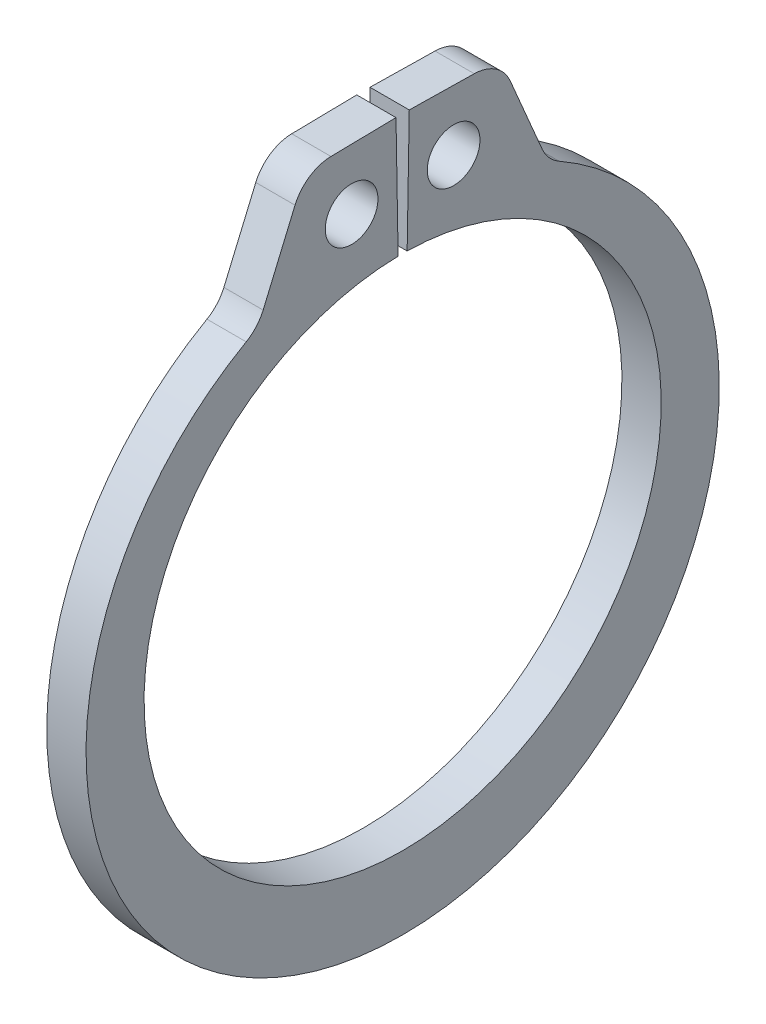
ISO-10303-21;
HEADER;
FILE_DESCRIPTION(('STEP AP214'),'2;1');
FILE_NAME('part.step','',(''),(''),'','','');
FILE_SCHEMA(('AUTOMOTIVE_DESIGN { 1 0 10303 214 1 1 1 1 }'));
ENDSEC;
DATA;
#1=APPLICATION_CONTEXT('core data for automotive mechanical design processes');
#2=APPLICATION_PROTOCOL_DEFINITION('international standard','automotive_design',2000,#1);
#3=PRODUCT_CONTEXT('',#1,'mechanical');
#4=PRODUCT('Part','Part','',(#3));
#5=PRODUCT_RELATED_PRODUCT_CATEGORY('part','',(#4));
#6=PRODUCT_DEFINITION_FORMATION('','',#4);
#7=PRODUCT_DEFINITION_CONTEXT('part definition',#1,'design');
#8=PRODUCT_DEFINITION('design','',#6,#7);
#9=PRODUCT_DEFINITION_SHAPE('','',#8);
#10=(LENGTH_UNIT() NAMED_UNIT(*) SI_UNIT(.MILLI.,.METRE.));
#11=(NAMED_UNIT(*) PLANE_ANGLE_UNIT() SI_UNIT($,.RADIAN.));
#12=(NAMED_UNIT(*) SI_UNIT($,.STERADIAN.) SOLID_ANGLE_UNIT());
#13=UNCERTAINTY_MEASURE_WITH_UNIT(LENGTH_MEASURE(1.E-05),#10,'distance_accuracy_value','');
#14=(GEOMETRIC_REPRESENTATION_CONTEXT(3) GLOBAL_UNCERTAINTY_ASSIGNED_CONTEXT((#13)) GLOBAL_UNIT_ASSIGNED_CONTEXT((#10,
#11,#12)) REPRESENTATION_CONTEXT('',''));
#15=CARTESIAN_POINT('',(0.,0.,0.));
#16=DIRECTION('',(0.,0.,1.));
#17=DIRECTION('',(1.,0.,0.));
#18=AXIS2_PLACEMENT_3D('',#15,#16,#17);
#19=CARTESIAN_POINT('',(-0.4445,0.,0.));
#20=DIRECTION('',(1.,0.,0.));
#21=DIRECTION('',(0.,0.,-1.));
#22=AXIS2_PLACEMENT_3D('',#19,#20,#21);
#23=PLANE('',#22);
#24=CARTESIAN_POINT('',(-0.4445,7.20724610900658,-1.15465964864512));
#25=DIRECTION('',(-1.,0.,0.));
#26=DIRECTION('',(0.,0.,1.));
#27=AXIS2_PLACEMENT_3D('',#24,#25,#26);
#28=CIRCLE('',#27,0.5969);
#29=CARTESIAN_POINT('',(-0.4445,7.20724610900658,-0.557759648645124));
#30=VERTEX_POINT('',#29);
#31=EDGE_CURVE('E133',#30,#30,#28,.F.);
#32=ORIENTED_EDGE('',*,*,#31,.T.);
#33=EDGE_LOOP('',(#32));
#34=FACE_BOUND('',#33,.T.);
#35=CARTESIAN_POINT('',(-0.4445,7.66933071962558,1.60650376158788));
#36=DIRECTION('',(-1.,0.,0.));
#37=DIRECTION('',(0.,0.,1.));
#38=AXIS2_PLACEMENT_3D('',#35,#36,#37);
#39=CIRCLE('',#38,0.9017);
#40=CARTESIAN_POINT('',(-0.4445,8.5708933863481,1.62224059647238));
#41=VERTEX_POINT('',#40);
#42=CARTESIAN_POINT('',(-0.4445,8.02240621636442,2.43620285379096));
#43=VERTEX_POINT('',#42);
#44=EDGE_CURVE('E103',#41,#43,#39,.F.);
#45=ORIENTED_EDGE('',*,*,#44,.F.);
#46=DIRECTION('',(0.,0.01745240643729,-0.999847695156391));
#47=VECTOR('',#46,1.);
#48=CARTESIAN_POINT('',(-0.4445,8.59659049818515,0.15005404530712));
#49=LINE('',#48,#47);
#50=CARTESIAN_POINT('',(-0.4445,8.59659049818515,0.15005404530712));
#51=VERTEX_POINT('',#50);
#52=EDGE_CURVE('E98',#41,#51,#49,.T.);
#53=ORIENTED_EDGE('',*,*,#52,.T.);
#54=DIRECTION('',(0.,-0.999847695156391,-0.0174524064372833));
#55=VECTOR('',#54,1.);
#56=CARTESIAN_POINT('',(-0.4445,5.85380830083213,0.102178603968365));
#57=LINE('',#56,#55);
#58=CARTESIAN_POINT('',(-0.4445,5.85380830083213,0.102178603968365));
#59=VERTEX_POINT('',#58);
#60=EDGE_CURVE('E130',#51,#59,#57,.T.);
#61=ORIENTED_EDGE('',*,*,#60,.T.);
#62=CARTESIAN_POINT('',(-0.4445,0.,0.));
#63=DIRECTION('',(-1.,0.,0.));
#64=DIRECTION('',(0.,0.,1.));
#65=AXIS2_PLACEMENT_3D('',#62,#63,#64);
#66=CIRCLE('',#65,5.8547);
#67=CARTESIAN_POINT('',(-0.4445,5.85380830083213,-0.102178603968365));
#68=VERTEX_POINT('',#67);
#69=EDGE_CURVE('E180',#59,#68,#66,.F.);
#70=ORIENTED_EDGE('',*,*,#69,.T.);
#71=DIRECTION('',(0.,0.999847695156391,-0.0174524064372833));
#72=VECTOR('',#71,1.);
#73=CARTESIAN_POINT('',(-0.4445,5.85380830083213,-0.102178603968365));
#74=LINE('',#73,#72);
#75=CARTESIAN_POINT('',(-0.4445,8.59659049818515,-0.15005404530712));
#76=VERTEX_POINT('',#75);
#77=EDGE_CURVE('E140',#68,#76,#74,.T.);
#78=ORIENTED_EDGE('',*,*,#77,.T.);
#79=DIRECTION('',(0.,-0.01745240643729,-0.999847695156391));
#80=VECTOR('',#79,1.);
#81=CARTESIAN_POINT('',(-0.4445,8.59659049818515,-0.15005404530712));
#82=LINE('',#81,#80);
#83=CARTESIAN_POINT('',(-0.4445,8.5708933863481,-1.62224059647238));
#84=VERTEX_POINT('',#83);
#85=EDGE_CURVE('E147',#76,#84,#82,.T.);
#86=ORIENTED_EDGE('',*,*,#85,.T.);
#87=CARTESIAN_POINT('',(-0.4445,7.66933071962558,-1.60650376158788));
#88=DIRECTION('',(-1.,0.,0.));
#89=DIRECTION('',(0.,0.,1.));
#90=AXIS2_PLACEMENT_3D('',#87,#88,#89);
#91=CIRCLE('',#90,0.9017);
#92=CARTESIAN_POINT('',(-0.4445,8.02240621636442,-2.43620285379096));
#93=VERTEX_POINT('',#92);
#94=EDGE_CURVE('E150',#93,#84,#91,.F.);
#95=ORIENTED_EDGE('',*,*,#94,.F.);
#96=DIRECTION('',(0.,-0.920149819455567,-0.391566481910656));
#97=VECTOR('',#96,1.);
#98=CARTESIAN_POINT('',(-0.4445,8.56068391718107,-2.20714069332188));
#99=LINE('',#98,#97);
#100=CARTESIAN_POINT('',(-0.4445,6.32616456625773,-3.15803245301383));
#101=VERTEX_POINT('',#100);
#102=EDGE_CURVE('E153',#93,#101,#99,.T.);
#103=ORIENTED_EDGE('',*,*,#102,.T.);
#104=CARTESIAN_POINT('',(-0.4445,6.67924006299657,-3.98773154521692));
#105=DIRECTION('',(-1.,0.,0.));
#106=DIRECTION('',(0.,0.,1.));
#107=AXIS2_PLACEMENT_3D('',#104,#105,#106);
#108=CIRCLE('',#107,0.9017);
#109=CARTESIAN_POINT('',(-0.4445,5.89530863003734,-3.54218199868087));
#110=VERTEX_POINT('',#109);
#111=EDGE_CURVE('E186',#101,#110,#108,.F.);
#112=ORIENTED_EDGE('',*,*,#111,.T.);
#113=CARTESIAN_POINT('',(-0.4445,-0.337057291142251,0.));
#114=DIRECTION('',(-1.,0.,0.));
#115=DIRECTION('',(0.,0.,1.));
#116=AXIS2_PLACEMENT_3D('',#113,#114,#115);
#117=CIRCLE('',#116,7.16864270885775);
#118=CARTESIAN_POINT('',(-0.4445,5.89530863003733,3.54218199868087));
#119=VERTEX_POINT('',#118);
#120=EDGE_CURVE('E188',#119,#110,#117,.F.);
#121=ORIENTED_EDGE('',*,*,#120,.F.);
#122=CARTESIAN_POINT('',(-0.4445,6.67924006299657,3.98773154521692));
#123=DIRECTION('',(-1.,0.,0.));
#124=DIRECTION('',(0.,0.,1.));
#125=AXIS2_PLACEMENT_3D('',#122,#123,#124);
#126=CIRCLE('',#125,0.9017);
#127=CARTESIAN_POINT('',(-0.4445,6.32616456625773,3.15803245301383));
#128=VERTEX_POINT('',#127);
#129=EDGE_CURVE('E116',#119,#128,#126,.F.);
#130=ORIENTED_EDGE('',*,*,#129,.T.);
#131=DIRECTION('',(0.,0.920149819455567,-0.391566481910656));
#132=VECTOR('',#131,1.);
#133=CARTESIAN_POINT('',(-0.4445,8.56068391718107,2.20714069332188));
#134=LINE('',#133,#132);
#135=EDGE_CURVE('E113',#128,#43,#134,.T.);
#136=ORIENTED_EDGE('',*,*,#135,.T.);
#137=EDGE_LOOP('',(#45,#53,#61,#70,#78,#86,#95,#103,#112,#121,#130,#136));
#138=FACE_BOUND('',#137,.T.);
#139=CARTESIAN_POINT('',(-0.4445,7.20724610900658,1.15465964864512));
#140=DIRECTION('',(-1.,0.,0.));
#141=DIRECTION('',(0.,0.,1.));
#142=AXIS2_PLACEMENT_3D('',#139,#140,#141);
#143=CIRCLE('',#142,0.5969);
#144=CARTESIAN_POINT('',(-0.4445,7.20724610900658,1.75155964864512));
#145=VERTEX_POINT('',#144);
#146=EDGE_CURVE('E20',#145,#145,#143,.F.);
#147=ORIENTED_EDGE('',*,*,#146,.T.);
#148=EDGE_LOOP('',(#147));
#149=FACE_BOUND('',#148,.T.);
#150=ADVANCED_FACE('F17',(#34,#138,#149),#23,.F.);
#151=CARTESIAN_POINT('',(0.4445,7.20724610900658,1.15465964864512));
#152=DIRECTION('',(-1.,0.,0.));
#153=DIRECTION('',(0.,0.,1.));
#154=AXIS2_PLACEMENT_3D('',#151,#152,#153);
#155=CYLINDRICAL_SURFACE('',#154,0.5969);
#156=CARTESIAN_POINT('',(0.4445,7.20724610900658,1.15465964864512));
#157=DIRECTION('',(-1.,0.,0.));
#158=DIRECTION('',(0.,0.,1.));
#159=AXIS2_PLACEMENT_3D('',#156,#157,#158);
#160=CIRCLE('',#159,0.5969);
#161=CARTESIAN_POINT('',(0.4445,7.20724610900658,1.75155964864512));
#162=VERTEX_POINT('',#161);
#163=EDGE_CURVE('E175',#162,#162,#160,.T.);
#164=ORIENTED_EDGE('',*,*,#163,.F.);
#165=EDGE_LOOP('',(#164));
#166=FACE_BOUND('',#165,.T.);
#167=ORIENTED_EDGE('',*,*,#146,.F.);
#168=EDGE_LOOP('',(#167));
#169=FACE_BOUND('',#168,.T.);
#170=ADVANCED_FACE('F388',(#166,#169),#155,.F.);
#171=CARTESIAN_POINT('',(0.4445,8.59659049818515,0.15005404530712));
#172=DIRECTION('',(0.,-0.999847695156391,-0.01745240643729));
#173=DIRECTION('',(0.,0.01745240643729,-0.999847695156391));
#174=AXIS2_PLACEMENT_3D('',#171,#172,#173);
#175=PLANE('',#174);
#176=DIRECTION('',(-1.,0.,0.));
#177=VECTOR('',#176,1.);
#178=CARTESIAN_POINT('',(0.4445,8.5708933863481,1.62224059647238));
#179=LINE('',#178,#177);
#180=CARTESIAN_POINT('',(0.4445,8.5708933863481,1.62224059647238));
#181=VERTEX_POINT('',#180);
#182=EDGE_CURVE('E110',#181,#41,#179,.T.);
#183=ORIENTED_EDGE('',*,*,#182,.F.);
#184=DIRECTION('',(0.,-0.0174524064372901,0.999847695156391));
#185=VECTOR('',#184,1.);
#186=CARTESIAN_POINT('',(0.4445,8.59659049818515,0.15005404530712));
#187=LINE('',#186,#185);
#188=CARTESIAN_POINT('',(0.4445,8.59659049818515,0.15005404530712));
#189=VERTEX_POINT('',#188);
#190=EDGE_CURVE('E174',#189,#181,#187,.T.);
#191=ORIENTED_EDGE('',*,*,#190,.F.);
#192=DIRECTION('',(1.,0.,0.));
#193=VECTOR('',#192,1.);
#194=CARTESIAN_POINT('',(0.4445,8.59659049818515,0.15005404530712));
#195=LINE('',#194,#193);
#196=EDGE_CURVE('E134',#189,#51,#195,.F.);
#197=ORIENTED_EDGE('',*,*,#196,.T.);
#198=ORIENTED_EDGE('',*,*,#52,.F.);
#199=EDGE_LOOP('',(#183,#191,#197,#198));
#200=FACE_BOUND('',#199,.T.);
#201=ADVANCED_FACE('F238',(#200),#175,.F.);
#202=CARTESIAN_POINT('',(0.4445,7.66933071962558,1.60650376158788));
#203=DIRECTION('',(-1.,0.,0.));
#204=DIRECTION('',(0.,0.,1.));
#205=AXIS2_PLACEMENT_3D('',#202,#203,#204);
#206=CYLINDRICAL_SURFACE('',#205,0.9017);
#207=ORIENTED_EDGE('',*,*,#44,.T.);
#208=DIRECTION('',(1.,0.,0.));
#209=VECTOR('',#208,1.);
#210=CARTESIAN_POINT('',(0.4445,8.02240621636442,2.43620285379096));
#211=LINE('',#210,#209);
#212=CARTESIAN_POINT('',(0.4445,8.02240621636442,2.43620285379096));
#213=VERTEX_POINT('',#212);
#214=EDGE_CURVE('E108',#43,#213,#211,.T.);
#215=ORIENTED_EDGE('',*,*,#214,.T.);
#216=CARTESIAN_POINT('',(0.4445,7.66933071962558,1.60650376158788));
#217=DIRECTION('',(-1.,0.,0.));
#218=DIRECTION('',(0.,0.,1.));
#219=AXIS2_PLACEMENT_3D('',#216,#217,#218);
#220=CIRCLE('',#219,0.9017);
#221=EDGE_CURVE('E172',#181,#213,#220,.F.);
#222=ORIENTED_EDGE('',*,*,#221,.F.);
#223=ORIENTED_EDGE('',*,*,#182,.T.);
#224=EDGE_LOOP('',(#207,#215,#222,#223));
#225=FACE_BOUND('',#224,.T.);
#226=ADVANCED_FACE('F105',(#225),#206,.T.);
#227=CARTESIAN_POINT('',(0.4445,8.56068391718107,2.20714069332188));
#228=DIRECTION('',(0.,-0.391566481910656,-0.920149819455567));
#229=DIRECTION('',(0.,0.920149819455567,-0.391566481910656));
#230=AXIS2_PLACEMENT_3D('',#227,#228,#229);
#231=PLANE('',#230);
#232=DIRECTION('',(-1.,0.,0.));
#233=VECTOR('',#232,1.);
#234=CARTESIAN_POINT('',(0.4445,6.32616456625773,3.15803245301383));
#235=LINE('',#234,#233);
#236=CARTESIAN_POINT('',(0.4445,6.32616456625773,3.15803245301383));
#237=VERTEX_POINT('',#236);
#238=EDGE_CURVE('E127',#128,#237,#235,.F.);
#239=ORIENTED_EDGE('',*,*,#238,.T.);
#240=DIRECTION('',(0.,-0.920149819455566,0.391566481910657));
#241=VECTOR('',#240,1.);
#242=CARTESIAN_POINT('',(0.4445,8.02240621636442,2.43620285379096));
#243=LINE('',#242,#241);
#244=EDGE_CURVE('E122',#213,#237,#243,.T.);
#245=ORIENTED_EDGE('',*,*,#244,.F.);
#246=ORIENTED_EDGE('',*,*,#214,.F.);
#247=ORIENTED_EDGE('',*,*,#135,.F.);
#248=EDGE_LOOP('',(#239,#245,#246,#247));
#249=FACE_BOUND('',#248,.T.);
#250=ADVANCED_FACE('F120',(#249),#231,.F.);
#251=CARTESIAN_POINT('',(0.4445,6.67924006299657,3.98773154521692));
#252=DIRECTION('',(-1.,0.,0.));
#253=DIRECTION('',(0.,0.,1.));
#254=AXIS2_PLACEMENT_3D('',#251,#252,#253);
#255=CYLINDRICAL_SURFACE('',#254,0.9017);
#256=ORIENTED_EDGE('',*,*,#238,.F.);
#257=ORIENTED_EDGE('',*,*,#129,.F.);
#258=DIRECTION('',(-1.,0.,0.));
#259=VECTOR('',#258,1.);
#260=CARTESIAN_POINT('',(0.4445,5.89530863003733,3.54218199868087));
#261=LINE('',#260,#259);
#262=CARTESIAN_POINT('',(0.4445,5.89530863003733,3.54218199868087));
#263=VERTEX_POINT('',#262);
#264=EDGE_CURVE('E191',#263,#119,#261,.T.);
#265=ORIENTED_EDGE('',*,*,#264,.F.);
#266=CARTESIAN_POINT('',(0.4445,6.67924006299657,3.98773154521692));
#267=DIRECTION('',(-1.,0.,0.));
#268=DIRECTION('',(0.,0.,1.));
#269=AXIS2_PLACEMENT_3D('',#266,#267,#268);
#270=CIRCLE('',#269,0.9017);
#271=EDGE_CURVE('E169',#237,#263,#270,.T.);
#272=ORIENTED_EDGE('',*,*,#271,.F.);
#273=EDGE_LOOP('',(#256,#257,#265,#272));
#274=FACE_BOUND('',#273,.T.);
#275=ADVANCED_FACE('F268',(#274),#255,.F.);
#276=CARTESIAN_POINT('',(0.4445,-0.337057291142251,0.));
#277=DIRECTION('',(-1.,0.,0.));
#278=DIRECTION('',(0.,0.,1.));
#279=AXIS2_PLACEMENT_3D('',#276,#277,#278);
#280=CYLINDRICAL_SURFACE('',#279,7.16864270885775);
#281=ORIENTED_EDGE('',*,*,#120,.T.);
#282=DIRECTION('',(-1.,0.,0.));
#283=VECTOR('',#282,1.);
#284=CARTESIAN_POINT('',(0.4445,5.89530863003733,-3.54218199868087));
#285=LINE('',#284,#283);
#286=CARTESIAN_POINT('',(0.4445,5.89530863003734,-3.54218199868087));
#287=VERTEX_POINT('',#286);
#288=EDGE_CURVE('E155',#110,#287,#285,.F.);
#289=ORIENTED_EDGE('',*,*,#288,.T.);
#290=CARTESIAN_POINT('',(0.4445,-0.337057291142251,0.));
#291=DIRECTION('',(-1.,0.,0.));
#292=DIRECTION('',(0.,0.,1.));
#293=AXIS2_PLACEMENT_3D('',#290,#291,#292);
#294=CIRCLE('',#293,7.16864270885775);
#295=EDGE_CURVE('E167',#263,#287,#294,.F.);
#296=ORIENTED_EDGE('',*,*,#295,.F.);
#297=ORIENTED_EDGE('',*,*,#264,.T.);
#298=EDGE_LOOP('',(#281,#289,#296,#297));
#299=FACE_BOUND('',#298,.T.);
#300=ADVANCED_FACE('F266',(#299),#280,.T.);
#301=CARTESIAN_POINT('',(0.4445,6.67924006299657,-3.98773154521692));
#302=DIRECTION('',(-1.,0.,0.));
#303=DIRECTION('',(0.,0.,1.));
#304=AXIS2_PLACEMENT_3D('',#301,#302,#303);
#305=CYLINDRICAL_SURFACE('',#304,0.9017);
#306=ORIENTED_EDGE('',*,*,#288,.F.);
#307=ORIENTED_EDGE('',*,*,#111,.F.);
#308=DIRECTION('',(1.,0.,0.));
#309=VECTOR('',#308,1.);
#310=CARTESIAN_POINT('',(0.4445,6.32616456625773,-3.15803245301383));
#311=LINE('',#310,#309);
#312=CARTESIAN_POINT('',(0.4445,6.32616456625773,-3.15803245301383));
#313=VERTEX_POINT('',#312);
#314=EDGE_CURVE('E154',#101,#313,#311,.T.);
#315=ORIENTED_EDGE('',*,*,#314,.T.);
#316=CARTESIAN_POINT('',(0.4445,6.67924006299657,-3.98773154521692));
#317=DIRECTION('',(-1.,0.,0.));
#318=DIRECTION('',(0.,0.,1.));
#319=AXIS2_PLACEMENT_3D('',#316,#317,#318);
#320=CIRCLE('',#319,0.9017);
#321=EDGE_CURVE('E164',#287,#313,#320,.T.);
#322=ORIENTED_EDGE('',*,*,#321,.F.);
#323=EDGE_LOOP('',(#306,#307,#315,#322));
#324=FACE_BOUND('',#323,.T.);
#325=ADVANCED_FACE('F264',(#324),#305,.F.);
#326=CARTESIAN_POINT('',(0.4445,8.56068391718107,-2.20714069332188));
#327=DIRECTION('',(0.,-0.391566481910656,0.920149819455567));
#328=DIRECTION('',(0.,-0.920149819455567,-0.391566481910656));
#329=AXIS2_PLACEMENT_3D('',#326,#327,#328);
#330=PLANE('',#329);
#331=ORIENTED_EDGE('',*,*,#314,.F.);
#332=ORIENTED_EDGE('',*,*,#102,.F.);
#333=DIRECTION('',(-1.,0.,0.));
#334=VECTOR('',#333,1.);
#335=CARTESIAN_POINT('',(0.4445,8.02240621636442,-2.43620285379096));
#336=LINE('',#335,#334);
#337=CARTESIAN_POINT('',(0.4445,8.02240621636442,-2.43620285379096));
#338=VERTEX_POINT('',#337);
#339=EDGE_CURVE('E185',#338,#93,#336,.T.);
#340=ORIENTED_EDGE('',*,*,#339,.F.);
#341=DIRECTION('',(0.,0.920149819455566,0.391566481910657));
#342=VECTOR('',#341,1.);
#343=CARTESIAN_POINT('',(0.4445,6.32616456625773,-3.15803245301383));
#344=LINE('',#343,#342);
#345=EDGE_CURVE('E163',#313,#338,#344,.T.);
#346=ORIENTED_EDGE('',*,*,#345,.F.);
#347=EDGE_LOOP('',(#331,#332,#340,#346));
#348=FACE_BOUND('',#347,.T.);
#349=ADVANCED_FACE('F260',(#348),#330,.F.);
#350=CARTESIAN_POINT('',(0.4445,7.66933071962558,-1.60650376158788));
#351=DIRECTION('',(-1.,0.,0.));
#352=DIRECTION('',(0.,0.,1.));
#353=AXIS2_PLACEMENT_3D('',#350,#351,#352);
#354=CYLINDRICAL_SURFACE('',#353,0.9017);
#355=ORIENTED_EDGE('',*,*,#94,.T.);
#356=DIRECTION('',(1.,0.,0.));
#357=VECTOR('',#356,1.);
#358=CARTESIAN_POINT('',(0.4445,8.5708933863481,-1.62224059647238));
#359=LINE('',#358,#357);
#360=CARTESIAN_POINT('',(0.4445,8.5708933863481,-1.62224059647238));
#361=VERTEX_POINT('',#360);
#362=EDGE_CURVE('E149',#84,#361,#359,.T.);
#363=ORIENTED_EDGE('',*,*,#362,.T.);
#364=CARTESIAN_POINT('',(0.4445,7.66933071962558,-1.60650376158788));
#365=DIRECTION('',(-1.,0.,0.));
#366=DIRECTION('',(0.,0.,1.));
#367=AXIS2_PLACEMENT_3D('',#364,#365,#366);
#368=CIRCLE('',#367,0.9017);
#369=EDGE_CURVE('E159',#338,#361,#368,.F.);
#370=ORIENTED_EDGE('',*,*,#369,.F.);
#371=ORIENTED_EDGE('',*,*,#339,.T.);
#372=EDGE_LOOP('',(#355,#363,#370,#371));
#373=FACE_BOUND('',#372,.T.);
#374=ADVANCED_FACE('F255',(#373),#354,.T.);
#375=CARTESIAN_POINT('',(0.4445,8.59659049818515,-0.15005404530712));
#376=DIRECTION('',(0.,-0.999847695156391,0.01745240643729));
#377=DIRECTION('',(0.,-0.01745240643729,-0.999847695156391));
#378=AXIS2_PLACEMENT_3D('',#375,#376,#377);
#379=PLANE('',#378);
#380=ORIENTED_EDGE('',*,*,#362,.F.);
#381=ORIENTED_EDGE('',*,*,#85,.F.);
#382=DIRECTION('',(1.,0.,0.));
#383=VECTOR('',#382,1.);
#384=CARTESIAN_POINT('',(0.4445,8.59659049818515,-0.15005404530712));
#385=LINE('',#384,#383);
#386=CARTESIAN_POINT('',(0.4445,8.59659049818515,-0.15005404530712));
#387=VERTEX_POINT('',#386);
#388=EDGE_CURVE('E144',#76,#387,#385,.T.);
#389=ORIENTED_EDGE('',*,*,#388,.T.);
#390=DIRECTION('',(0.,0.0174524064372901,0.999847695156391));
#391=VECTOR('',#390,1.);
#392=CARTESIAN_POINT('',(0.4445,8.5708933863481,-1.62224059647238));
#393=LINE('',#392,#391);
#394=EDGE_CURVE('E162',#361,#387,#393,.T.);
#395=ORIENTED_EDGE('',*,*,#394,.F.);
#396=EDGE_LOOP('',(#380,#381,#389,#395));
#397=FACE_BOUND('',#396,.T.);
#398=ADVANCED_FACE('F252',(#397),#379,.F.);
#399=CARTESIAN_POINT('',(0.4445,5.85380830083213,-0.102178603968365));
#400=DIRECTION('',(0.,-0.0174524064372833,-0.999847695156391));
#401=DIRECTION('',(0.,0.999847695156391,-0.0174524064372833));
#402=AXIS2_PLACEMENT_3D('',#399,#400,#401);
#403=PLANE('',#402);
#404=DIRECTION('',(-1.,0.,0.));
#405=VECTOR('',#404,1.);
#406=CARTESIAN_POINT('',(0.4445,5.85380830083213,-0.102178603968365));
#407=LINE('',#406,#405);
#408=CARTESIAN_POINT('',(0.4445,5.85380830083213,-0.102178603968365));
#409=VERTEX_POINT('',#408);
#410=EDGE_CURVE('E143',#68,#409,#407,.F.);
#411=ORIENTED_EDGE('',*,*,#410,.T.);
#412=DIRECTION('',(0.,-0.999847695156391,0.0174524064372833));
#413=VECTOR('',#412,1.);
#414=CARTESIAN_POINT('',(0.4445,8.59659049818515,-0.15005404530712));
#415=LINE('',#414,#413);
#416=EDGE_CURVE('E158',#387,#409,#415,.T.);
#417=ORIENTED_EDGE('',*,*,#416,.F.);
#418=ORIENTED_EDGE('',*,*,#388,.F.);
#419=ORIENTED_EDGE('',*,*,#77,.F.);
#420=EDGE_LOOP('',(#411,#417,#418,#419));
#421=FACE_BOUND('',#420,.T.);
#422=ADVANCED_FACE('F244',(#421),#403,.F.);
#423=CARTESIAN_POINT('',(0.4445,0.,0.));
#424=DIRECTION('',(-1.,0.,0.));
#425=DIRECTION('',(0.,0.,1.));
#426=AXIS2_PLACEMENT_3D('',#423,#424,#425);
#427=CYLINDRICAL_SURFACE('',#426,5.8547);
#428=DIRECTION('',(1.,0.,0.));
#429=VECTOR('',#428,1.);
#430=CARTESIAN_POINT('',(0.4445,5.85380830083213,0.102178603968365));
#431=LINE('',#430,#429);
#432=CARTESIAN_POINT('',(0.4445,5.85380830083213,0.102178603968365));
#433=VERTEX_POINT('',#432);
#434=EDGE_CURVE('E182',#59,#433,#431,.T.);
#435=ORIENTED_EDGE('',*,*,#434,.T.);
#436=CARTESIAN_POINT('',(0.4445,0.,0.));
#437=DIRECTION('',(-1.,0.,0.));
#438=DIRECTION('',(0.,0.,1.));
#439=AXIS2_PLACEMENT_3D('',#436,#437,#438);
#440=CIRCLE('',#439,5.8547);
#441=EDGE_CURVE('E35',#409,#433,#440,.T.);
#442=ORIENTED_EDGE('',*,*,#441,.F.);
#443=ORIENTED_EDGE('',*,*,#410,.F.);
#444=ORIENTED_EDGE('',*,*,#69,.F.);
#445=EDGE_LOOP('',(#435,#442,#443,#444));
#446=FACE_BOUND('',#445,.T.);
#447=ADVANCED_FACE('F246',(#446),#427,.F.);
#448=CARTESIAN_POINT('',(0.4445,5.85380830083213,0.102178603968365));
#449=DIRECTION('',(0.,-0.0174524064372833,0.999847695156391));
#450=DIRECTION('',(0.,-0.999847695156391,-0.0174524064372833));
#451=AXIS2_PLACEMENT_3D('',#448,#449,#450);
#452=PLANE('',#451);
#453=ORIENTED_EDGE('',*,*,#196,.F.);
#454=DIRECTION('',(0.,0.999847695156391,0.0174524064372833));
#455=VECTOR('',#454,1.);
#456=CARTESIAN_POINT('',(0.4445,5.85380830083213,0.102178603968365));
#457=LINE('',#456,#455);
#458=EDGE_CURVE('E26',#433,#189,#457,.T.);
#459=ORIENTED_EDGE('',*,*,#458,.F.);
#460=ORIENTED_EDGE('',*,*,#434,.F.);
#461=ORIENTED_EDGE('',*,*,#60,.F.);
#462=EDGE_LOOP('',(#453,#459,#460,#461));
#463=FACE_BOUND('',#462,.T.);
#464=ADVANCED_FACE('F236',(#463),#452,.F.);
#465=CARTESIAN_POINT('',(0.4445,7.20724610900658,-1.15465964864512));
#466=DIRECTION('',(-1.,0.,0.));
#467=DIRECTION('',(0.,0.,1.));
#468=AXIS2_PLACEMENT_3D('',#465,#466,#467);
#469=CYLINDRICAL_SURFACE('',#468,0.5969);
#470=CARTESIAN_POINT('',(0.4445,7.20724610900658,-1.15465964864512));
#471=DIRECTION('',(-1.,0.,0.));
#472=DIRECTION('',(0.,0.,1.));
#473=AXIS2_PLACEMENT_3D('',#470,#471,#472);
#474=CIRCLE('',#473,0.5969);
#475=CARTESIAN_POINT('',(0.4445,7.20724610900658,-0.557759648645124));
#476=VERTEX_POINT('',#475);
#477=EDGE_CURVE('E11',#476,#476,#474,.T.);
#478=ORIENTED_EDGE('',*,*,#477,.F.);
#479=EDGE_LOOP('',(#478));
#480=FACE_BOUND('',#479,.T.);
#481=ORIENTED_EDGE('',*,*,#31,.F.);
#482=EDGE_LOOP('',(#481));
#483=FACE_BOUND('',#482,.T.);
#484=ADVANCED_FACE('F279',(#480,#483),#469,.F.);
#485=CARTESIAN_POINT('',(0.4445,0.,0.));
#486=DIRECTION('',(1.,0.,0.));
#487=DIRECTION('',(0.,0.,-1.));
#488=AXIS2_PLACEMENT_3D('',#485,#486,#487);
#489=PLANE('',#488);
#490=ORIENTED_EDGE('',*,*,#477,.T.);
#491=EDGE_LOOP('',(#490));
#492=FACE_BOUND('',#491,.T.);
#493=ORIENTED_EDGE('',*,*,#441,.T.);
#494=ORIENTED_EDGE('',*,*,#458,.T.);
#495=ORIENTED_EDGE('',*,*,#190,.T.);
#496=ORIENTED_EDGE('',*,*,#221,.T.);
#497=ORIENTED_EDGE('',*,*,#244,.T.);
#498=ORIENTED_EDGE('',*,*,#271,.T.);
#499=ORIENTED_EDGE('',*,*,#295,.T.);
#500=ORIENTED_EDGE('',*,*,#321,.T.);
#501=ORIENTED_EDGE('',*,*,#345,.T.);
#502=ORIENTED_EDGE('',*,*,#369,.T.);
#503=ORIENTED_EDGE('',*,*,#394,.T.);
#504=ORIENTED_EDGE('',*,*,#416,.T.);
#505=EDGE_LOOP('',(#493,#494,#495,#496,#497,#498,#499,#500,#501,#502,#503,#504));
#506=FACE_BOUND('',#505,.T.);
#507=ORIENTED_EDGE('',*,*,#163,.T.);
#508=EDGE_LOOP('',(#507));
#509=FACE_BOUND('',#508,.T.);
#510=ADVANCED_FACE('F229',(#492,#506,#509),#489,.T.);
#511=CLOSED_SHELL('',(#150,#170,#201,#226,#250,#275,#300,#325,#349,#374,#398,#422,#447,#464,
#484,#510));
#512=MANIFOLD_SOLID_BREP('B1',#511);
#513=ADVANCED_BREP_SHAPE_REPRESENTATION('',(#18,#512),#14);
#514=SHAPE_DEFINITION_REPRESENTATION(#9,#513);
ENDSEC;
END-ISO-10303-21;
